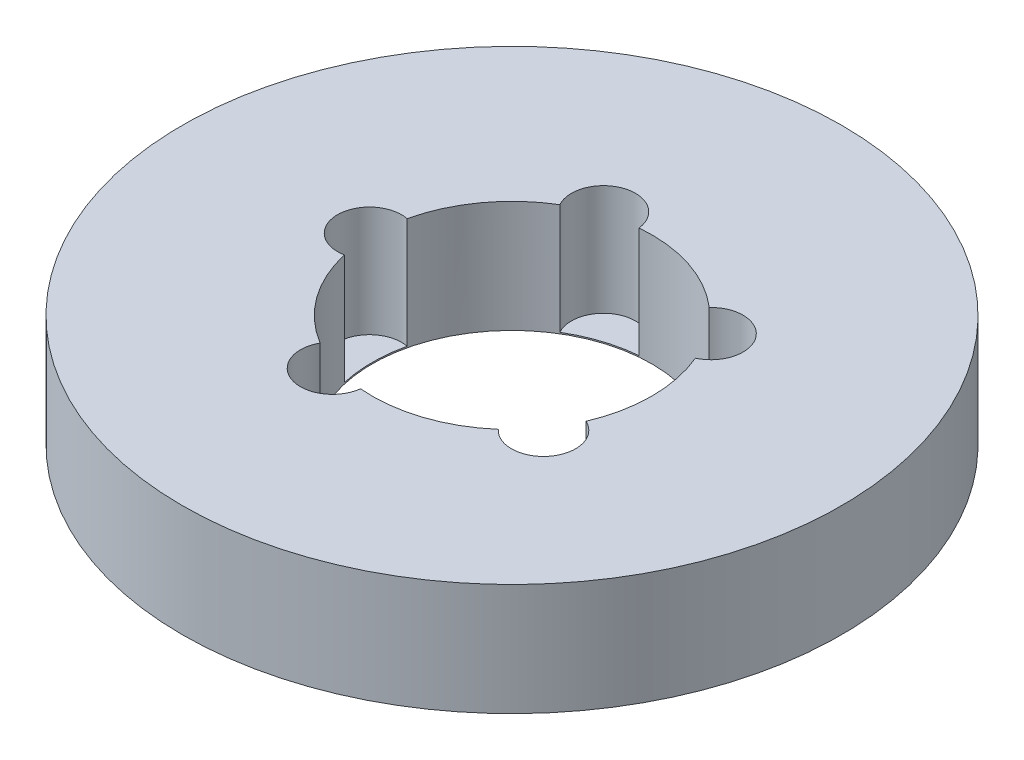
ISO-10303-21;
HEADER;
FILE_DESCRIPTION(('STEP AP214'),'2;1');
FILE_NAME('part.step','',(''),(''),'','','');
FILE_SCHEMA(('AUTOMOTIVE_DESIGN { 1 0 10303 214 1 1 1 1 }'));
ENDSEC;
DATA;
#1=APPLICATION_CONTEXT('core data for automotive mechanical design processes');
#2=APPLICATION_PROTOCOL_DEFINITION('international standard','automotive_design',2000,#1);
#3=PRODUCT_CONTEXT('',#1,'mechanical');
#4=PRODUCT('Part','Part','',(#3));
#5=PRODUCT_RELATED_PRODUCT_CATEGORY('part','',(#4));
#6=PRODUCT_DEFINITION_FORMATION('','',#4);
#7=PRODUCT_DEFINITION_CONTEXT('part definition',#1,'design');
#8=PRODUCT_DEFINITION('design','',#6,#7);
#9=PRODUCT_DEFINITION_SHAPE('','',#8);
#10=(LENGTH_UNIT() NAMED_UNIT(*) SI_UNIT(.MILLI.,.METRE.));
#11=(NAMED_UNIT(*) PLANE_ANGLE_UNIT() SI_UNIT($,.RADIAN.));
#12=(NAMED_UNIT(*) SI_UNIT($,.STERADIAN.) SOLID_ANGLE_UNIT());
#13=UNCERTAINTY_MEASURE_WITH_UNIT(LENGTH_MEASURE(1.E-05),#10,'distance_accuracy_value','');
#14=(GEOMETRIC_REPRESENTATION_CONTEXT(3) GLOBAL_UNCERTAINTY_ASSIGNED_CONTEXT((#13)) GLOBAL_UNIT_ASSIGNED_CONTEXT((#10,
#11,#12)) REPRESENTATION_CONTEXT('',''));
#15=CARTESIAN_POINT('',(0.,0.,0.));
#16=DIRECTION('',(0.,0.,1.));
#17=DIRECTION('',(1.,0.,0.));
#18=AXIS2_PLACEMENT_3D('',#15,#16,#17);
#19=CARTESIAN_POINT('',(0.,28.,0.));
#20=DIRECTION('',(0.,-1.,0.));
#21=DIRECTION('',(0.,0.,-1.));
#22=AXIS2_PLACEMENT_3D('',#19,#20,#21);
#23=CYLINDRICAL_SURFACE('',#22,82.5);
#24=CARTESIAN_POINT('',(0.,28.,0.));
#25=DIRECTION('',(0.,1.,0.));
#26=DIRECTION('',(0.,0.,1.));
#27=AXIS2_PLACEMENT_3D('',#24,#25,#26);
#28=CIRCLE('',#27,82.5);
#29=CARTESIAN_POINT('',(0.,28.,82.5));
#30=VERTEX_POINT('',#29);
#31=EDGE_CURVE('E157',#30,#30,#28,.T.);
#32=ORIENTED_EDGE('',*,*,#31,.F.);
#33=EDGE_LOOP('',(#32));
#34=FACE_BOUND('',#33,.T.);
#35=CARTESIAN_POINT('',(0.,0.,0.));
#36=DIRECTION('',(0.,1.,0.));
#37=DIRECTION('',(0.,0.,1.));
#38=AXIS2_PLACEMENT_3D('',#35,#36,#37);
#39=CIRCLE('',#38,82.5);
#40=CARTESIAN_POINT('',(0.,0.,82.5));
#41=VERTEX_POINT('',#40);
#42=EDGE_CURVE('E150',#41,#41,#39,.T.);
#43=ORIENTED_EDGE('',*,*,#42,.T.);
#44=EDGE_LOOP('',(#43));
#45=FACE_BOUND('',#44,.T.);
#46=ADVANCED_FACE('F39',(#34,#45),#23,.T.);
#47=CARTESIAN_POINT('',(0.,28.,0.));
#48=DIRECTION('',(0.,1.,0.));
#49=DIRECTION('',(0.,0.,1.));
#50=AXIS2_PLACEMENT_3D('',#47,#48,#49);
#51=PLANE('',#50);
#52=CARTESIAN_POINT('',(-11.0212875243932,28.,-33.9200351722985));
#53=DIRECTION('',(0.,1.,0.));
#54=DIRECTION('',(-0.95105651629515,0.,0.309016994374958));
#55=AXIS2_PLACEMENT_3D('',#52,#53,#54);
#56=CIRCLE('',#55,8.02054044185221);
#57=CARTESIAN_POINT('',(-3.0567584288251,28.,-34.8662620294721));
#58=VERTEX_POINT('',#57);
#59=CARTESIAN_POINT('',(-18.020905106871,28.,-30.0041160364566));
#60=VERTEX_POINT('',#59);
#61=EDGE_CURVE('E194',#58,#60,#56,.T.);
#62=ORIENTED_EDGE('',*,*,#61,.F.);
#63=CARTESIAN_POINT('',(0.,28.,0.));
#64=DIRECTION('',(0.,1.,0.));
#65=DIRECTION('',(0.,0.,1.));
#66=AXIS2_PLACEMENT_3D('',#63,#64,#65);
#67=CIRCLE('',#66,35.);
#68=CARTESIAN_POINT('',(22.9668441401066,28.,-26.4106809878892));
#69=VERTEX_POINT('',#68);
#70=EDGE_CURVE('E147',#69,#58,#67,.T.);
#71=ORIENTED_EDGE('',*,*,#70,.F.);
#72=CARTESIAN_POINT('',(28.8541053386453,28.,-20.9637346360727));
#73=DIRECTION('',(0.,1.,0.));
#74=DIRECTION('',(-0.58778525229248,0.,-0.809016994374942));
#75=AXIS2_PLACEMENT_3D('',#72,#73,#74);
#76=CIRCLE('',#75,8.02054044185221);
#77=CARTESIAN_POINT('',(32.2151953997779,28.,-13.681417519911));
#78=VERTEX_POINT('',#77);
#79=EDGE_CURVE('E254',#78,#69,#76,.T.);
#80=ORIENTED_EDGE('',*,*,#79,.F.);
#81=CARTESIAN_POINT('',(32.2151953997781,28.,13.6814175199105));
#82=VERTEX_POINT('',#81);
#83=EDGE_CURVE('E144',#82,#78,#67,.T.);
#84=ORIENTED_EDGE('',*,*,#83,.F.);
#85=CARTESIAN_POINT('',(28.8541053386456,28.,20.9637346360723));
#86=DIRECTION('',(0.,1.,0.));
#87=DIRECTION('',(0.587785252292469,0.,-0.809016994374951));
#88=AXIS2_PLACEMENT_3D('',#85,#86,#87);
#89=CIRCLE('',#88,8.02054044185221);
#90=CARTESIAN_POINT('',(22.966844140107,28.,26.4106809878889));
#91=VERTEX_POINT('',#90);
#92=EDGE_CURVE('E141',#91,#82,#89,.T.);
#93=ORIENTED_EDGE('',*,*,#92,.F.);
#94=CARTESIAN_POINT('',(-3.05675842882461,28.,34.8662620294721));
#95=VERTEX_POINT('',#94);
#96=EDGE_CURVE('E134',#95,#91,#67,.T.);
#97=ORIENTED_EDGE('',*,*,#96,.F.);
#98=CARTESIAN_POINT('',(-11.0212875243927,28.,33.9200351722987));
#99=DIRECTION('',(0.,1.,0.));
#100=DIRECTION('',(0.951056516295155,0.,0.309016994374945));
#101=AXIS2_PLACEMENT_3D('',#98,#99,#100);
#102=CIRCLE('',#101,8.02054044185221);
#103=CARTESIAN_POINT('',(-18.0209051068706,28.,30.0041160364568));
#104=VERTEX_POINT('',#103);
#105=EDGE_CURVE('E111',#104,#95,#102,.T.);
#106=ORIENTED_EDGE('',*,*,#105,.F.);
#107=CARTESIAN_POINT('',(-34.1043760041894,28.,7.86711747496296));
#108=VERTEX_POINT('',#107);
#109=EDGE_CURVE('E145',#108,#104,#67,.T.);
#110=ORIENTED_EDGE('',*,*,#109,.F.);
#111=CARTESIAN_POINT('',(-35.6656356285054,28.,0.));
#112=DIRECTION('',(0.,1.,0.));
#113=DIRECTION('',(0.,0.,1.));
#114=AXIS2_PLACEMENT_3D('',#111,#112,#113);
#115=CIRCLE('',#114,8.02054044185221);
#116=CARTESIAN_POINT('',(-34.1043760041894,28.,-7.86711747496296));
#117=VERTEX_POINT('',#116);
#118=EDGE_CURVE('E153',#117,#108,#115,.T.);
#119=ORIENTED_EDGE('',*,*,#118,.F.);
#120=EDGE_CURVE('E146',#60,#117,#67,.T.);
#121=ORIENTED_EDGE('',*,*,#120,.F.);
#122=EDGE_LOOP('',(#62,#71,#80,#84,#93,#97,#106,#110,#119,#121));
#123=FACE_BOUND('',#122,.T.);
#124=ORIENTED_EDGE('',*,*,#31,.T.);
#125=EDGE_LOOP('',(#124));
#126=FACE_BOUND('',#125,.T.);
#127=ADVANCED_FACE('F139',(#123,#126),#51,.T.);
#128=CARTESIAN_POINT('',(0.,0.,0.));
#129=DIRECTION('',(0.,1.,0.));
#130=DIRECTION('',(0.,0.,1.));
#131=AXIS2_PLACEMENT_3D('',#128,#129,#130);
#132=PLANE('',#131);
#133=CARTESIAN_POINT('',(0.,0.,0.));
#134=DIRECTION('',(0.,1.,0.));
#135=DIRECTION('',(0.,0.,1.));
#136=AXIS2_PLACEMENT_3D('',#133,#134,#135);
#137=CIRCLE('',#136,35.);
#138=CARTESIAN_POINT('',(0.,0.,35.));
#139=VERTEX_POINT('',#138);
#140=EDGE_CURVE('E154',#139,#139,#137,.T.);
#141=ORIENTED_EDGE('',*,*,#140,.T.);
#142=EDGE_LOOP('',(#141));
#143=FACE_BOUND('',#142,.T.);
#144=ORIENTED_EDGE('',*,*,#42,.F.);
#145=EDGE_LOOP('',(#144));
#146=FACE_BOUND('',#145,.T.);
#147=ADVANCED_FACE('F213',(#143,#146),#132,.F.);
#148=CARTESIAN_POINT('',(0.,28.,0.));
#149=DIRECTION('',(0.,-1.,0.));
#150=DIRECTION('',(0.,0.,-1.));
#151=AXIS2_PLACEMENT_3D('',#148,#149,#150);
#152=CYLINDRICAL_SURFACE('',#151,35.);
#153=DIRECTION('',(0.,1.,0.));
#154=VECTOR('',#153,1.);
#155=CARTESIAN_POINT('',(-3.0567584288251,14.162641871456,-34.8662620294721));
#156=LINE('',#155,#154);
#157=CARTESIAN_POINT('',(-3.0567584288251,0.325283742912054,-34.8662620294721));
#158=VERTEX_POINT('',#157);
#159=EDGE_CURVE('E11',#158,#58,#156,.T.);
#160=ORIENTED_EDGE('',*,*,#159,.F.);
#161=CARTESIAN_POINT('',(0.,0.325283742912054,0.));
#162=DIRECTION('',(0.,1.,0.));
#163=DIRECTION('',(0.,0.,1.));
#164=AXIS2_PLACEMENT_3D('',#161,#162,#163);
#165=CIRCLE('',#164,35.);
#166=CARTESIAN_POINT('',(-18.020905106871,0.325283742912054,-30.0041160364566));
#167=VERTEX_POINT('',#166);
#168=EDGE_CURVE('E189',#158,#167,#165,.T.);
#169=ORIENTED_EDGE('',*,*,#168,.T.);
#170=DIRECTION('',(0.,1.,0.));
#171=VECTOR('',#170,1.);
#172=CARTESIAN_POINT('',(-18.020905106871,14.162641871456,-30.0041160364566));
#173=LINE('',#172,#171);
#174=EDGE_CURVE('E46',#60,#167,#173,.F.);
#175=ORIENTED_EDGE('',*,*,#174,.F.);
#176=ORIENTED_EDGE('',*,*,#120,.T.);
#177=DIRECTION('',(0.,1.,0.));
#178=VECTOR('',#177,1.);
#179=CARTESIAN_POINT('',(-34.1043760041894,14.162641871456,-7.86711747496296));
#180=LINE('',#179,#178);
#181=CARTESIAN_POINT('',(-34.1043760041894,0.325283742912054,-7.86711747496296));
#182=VERTEX_POINT('',#181);
#183=EDGE_CURVE('E168',#182,#117,#180,.T.);
#184=ORIENTED_EDGE('',*,*,#183,.F.);
#185=CARTESIAN_POINT('',(0.,0.325283742912054,0.));
#186=DIRECTION('',(0.,1.,0.));
#187=DIRECTION('',(0.,0.,1.));
#188=AXIS2_PLACEMENT_3D('',#185,#186,#187);
#189=CIRCLE('',#188,35.);
#190=CARTESIAN_POINT('',(-34.1043760041894,0.325283742912054,7.86711747496296));
#191=VERTEX_POINT('',#190);
#192=EDGE_CURVE('E165',#182,#191,#189,.T.);
#193=ORIENTED_EDGE('',*,*,#192,.T.);
#194=DIRECTION('',(0.,1.,0.));
#195=VECTOR('',#194,1.);
#196=CARTESIAN_POINT('',(-34.1043760041894,14.162641871456,7.86711747496296));
#197=LINE('',#196,#195);
#198=EDGE_CURVE('E170',#108,#191,#197,.F.);
#199=ORIENTED_EDGE('',*,*,#198,.F.);
#200=ORIENTED_EDGE('',*,*,#109,.T.);
#201=DIRECTION('',(0.,1.,0.));
#202=VECTOR('',#201,1.);
#203=CARTESIAN_POINT('',(-18.0209051068706,14.162641871456,30.0041160364568));
#204=LINE('',#203,#202);
#205=CARTESIAN_POINT('',(-18.0209051068706,0.325283742912054,30.0041160364568));
#206=VERTEX_POINT('',#205);
#207=EDGE_CURVE('E121',#206,#104,#204,.T.);
#208=ORIENTED_EDGE('',*,*,#207,.F.);
#209=CARTESIAN_POINT('',(0.,0.325283742912054,0.));
#210=DIRECTION('',(0.,1.,0.));
#211=DIRECTION('',(0.,0.,1.));
#212=AXIS2_PLACEMENT_3D('',#209,#210,#211);
#213=CIRCLE('',#212,35.);
#214=CARTESIAN_POINT('',(-3.05675842882461,0.325283742912054,34.8662620294721));
#215=VERTEX_POINT('',#214);
#216=EDGE_CURVE('E136',#206,#215,#213,.T.);
#217=ORIENTED_EDGE('',*,*,#216,.T.);
#218=DIRECTION('',(0.,1.,0.));
#219=VECTOR('',#218,1.);
#220=CARTESIAN_POINT('',(-3.05675842882461,14.162641871456,34.8662620294721));
#221=LINE('',#220,#219);
#222=EDGE_CURVE('E117',#95,#215,#221,.F.);
#223=ORIENTED_EDGE('',*,*,#222,.F.);
#224=ORIENTED_EDGE('',*,*,#96,.T.);
#225=DIRECTION('',(0.,1.,0.));
#226=VECTOR('',#225,1.);
#227=CARTESIAN_POINT('',(22.966844140107,14.162641871456,26.4106809878889));
#228=LINE('',#227,#226);
#229=CARTESIAN_POINT('',(22.966844140107,0.325283742912054,26.4106809878889));
#230=VERTEX_POINT('',#229);
#231=EDGE_CURVE('E182',#230,#91,#228,.T.);
#232=ORIENTED_EDGE('',*,*,#231,.F.);
#233=CARTESIAN_POINT('',(0.,0.325283742912054,0.));
#234=DIRECTION('',(0.,1.,0.));
#235=DIRECTION('',(0.,0.,1.));
#236=AXIS2_PLACEMENT_3D('',#233,#234,#235);
#237=CIRCLE('',#236,35.);
#238=CARTESIAN_POINT('',(32.2151953997781,0.325283742912054,13.6814175199105));
#239=VERTEX_POINT('',#238);
#240=EDGE_CURVE('E174',#230,#239,#237,.T.);
#241=ORIENTED_EDGE('',*,*,#240,.T.);
#242=DIRECTION('',(0.,1.,0.));
#243=VECTOR('',#242,1.);
#244=CARTESIAN_POINT('',(32.2151953997781,14.162641871456,13.6814175199105));
#245=LINE('',#244,#243);
#246=EDGE_CURVE('E177',#82,#239,#245,.F.);
#247=ORIENTED_EDGE('',*,*,#246,.F.);
#248=ORIENTED_EDGE('',*,*,#83,.T.);
#249=DIRECTION('',(0.,1.,0.));
#250=VECTOR('',#249,1.);
#251=CARTESIAN_POINT('',(32.2151953997779,14.162641871456,-13.681417519911));
#252=LINE('',#251,#250);
#253=CARTESIAN_POINT('',(32.2151953997779,0.325283742912054,-13.681417519911));
#254=VERTEX_POINT('',#253);
#255=EDGE_CURVE('E187',#254,#78,#252,.T.);
#256=ORIENTED_EDGE('',*,*,#255,.F.);
#257=CARTESIAN_POINT('',(0.,0.325283742912054,0.));
#258=DIRECTION('',(0.,1.,0.));
#259=DIRECTION('',(0.,0.,1.));
#260=AXIS2_PLACEMENT_3D('',#257,#258,#259);
#261=CIRCLE('',#260,35.);
#262=CARTESIAN_POINT('',(22.9668441401066,0.325283742912054,-26.4106809878892));
#263=VERTEX_POINT('',#262);
#264=EDGE_CURVE('E181',#254,#263,#261,.T.);
#265=ORIENTED_EDGE('',*,*,#264,.T.);
#266=DIRECTION('',(0.,1.,0.));
#267=VECTOR('',#266,1.);
#268=CARTESIAN_POINT('',(22.9668441401066,14.162641871456,-26.4106809878892));
#269=LINE('',#268,#267);
#270=EDGE_CURVE('E186',#69,#263,#269,.F.);
#271=ORIENTED_EDGE('',*,*,#270,.F.);
#272=ORIENTED_EDGE('',*,*,#70,.T.);
#273=EDGE_LOOP('',(#160,#169,#175,#176,#184,#193,#199,#200,#208,#217,#223,#224,#232,#241,#247,
#248,#256,#265,#271,#272));
#274=FACE_BOUND('',#273,.T.);
#275=ORIENTED_EDGE('',*,*,#140,.F.);
#276=EDGE_LOOP('',(#275));
#277=FACE_BOUND('',#276,.T.);
#278=ADVANCED_FACE('F135',(#274,#277),#152,.F.);
#279=CARTESIAN_POINT('',(-35.6656356285054,0.325283742912054,0.));
#280=DIRECTION('',(0.,1.,0.));
#281=DIRECTION('',(0.,0.,1.));
#282=AXIS2_PLACEMENT_3D('',#279,#280,#281);
#283=CYLINDRICAL_SURFACE('',#282,8.02054044185221);
#284=ORIENTED_EDGE('',*,*,#183,.T.);
#285=ORIENTED_EDGE('',*,*,#118,.T.);
#286=ORIENTED_EDGE('',*,*,#198,.T.);
#287=CARTESIAN_POINT('',(-35.6656356285054,0.325283742912054,0.));
#288=DIRECTION('',(0.,1.,0.));
#289=DIRECTION('',(0.,0.,1.));
#290=AXIS2_PLACEMENT_3D('',#287,#288,#289);
#291=CIRCLE('',#290,8.02054044185221);
#292=EDGE_CURVE('E158',#182,#191,#291,.T.);
#293=ORIENTED_EDGE('',*,*,#292,.F.);
#294=EDGE_LOOP('',(#284,#285,#286,#293));
#295=FACE_BOUND('',#294,.T.);
#296=ADVANCED_FACE('F221',(#295),#283,.F.);
#297=CARTESIAN_POINT('',(-35.6656356285054,0.325283742912054,0.));
#298=DIRECTION('',(0.,1.,0.));
#299=DIRECTION('',(0.,0.,1.));
#300=AXIS2_PLACEMENT_3D('',#297,#298,#299);
#301=PLANE('',#300);
#302=ORIENTED_EDGE('',*,*,#292,.T.);
#303=ORIENTED_EDGE('',*,*,#192,.F.);
#304=EDGE_LOOP('',(#302,#303));
#305=FACE_BOUND('',#304,.T.);
#306=ADVANCED_FACE('F227',(#305),#301,.T.);
#307=CARTESIAN_POINT('',(-11.0212875243927,0.325283742912054,33.9200351722987));
#308=DIRECTION('',(0.,1.,0.));
#309=DIRECTION('',(0.,0.,1.));
#310=AXIS2_PLACEMENT_3D('',#307,#308,#309);
#311=CYLINDRICAL_SURFACE('',#310,8.02054044185221);
#312=ORIENTED_EDGE('',*,*,#207,.T.);
#313=ORIENTED_EDGE('',*,*,#105,.T.);
#314=ORIENTED_EDGE('',*,*,#222,.T.);
#315=CARTESIAN_POINT('',(-11.0212875243927,0.325283742912054,33.9200351722987));
#316=DIRECTION('',(0.,1.,0.));
#317=DIRECTION('',(0.951056516295155,0.,0.309016994374945));
#318=AXIS2_PLACEMENT_3D('',#315,#316,#317);
#319=CIRCLE('',#318,8.02054044185221);
#320=EDGE_CURVE('E127',#206,#215,#319,.T.);
#321=ORIENTED_EDGE('',*,*,#320,.F.);
#322=EDGE_LOOP('',(#312,#313,#314,#321));
#323=FACE_BOUND('',#322,.T.);
#324=ADVANCED_FACE('F116',(#323),#311,.F.);
#325=CARTESIAN_POINT('',(-11.0212875243927,0.325283742912054,33.9200351722987));
#326=DIRECTION('',(0.,1.,0.));
#327=DIRECTION('',(0.951056516295155,0.,0.309016994374945));
#328=AXIS2_PLACEMENT_3D('',#325,#326,#327);
#329=PLANE('',#328);
#330=ORIENTED_EDGE('',*,*,#320,.T.);
#331=ORIENTED_EDGE('',*,*,#216,.F.);
#332=EDGE_LOOP('',(#330,#331));
#333=FACE_BOUND('',#332,.T.);
#334=ADVANCED_FACE('F234',(#333),#329,.T.);
#335=CARTESIAN_POINT('',(28.8541053386456,0.325283742912054,20.9637346360723));
#336=DIRECTION('',(0.,1.,0.));
#337=DIRECTION('',(0.,0.,1.));
#338=AXIS2_PLACEMENT_3D('',#335,#336,#337);
#339=CYLINDRICAL_SURFACE('',#338,8.02054044185221);
#340=ORIENTED_EDGE('',*,*,#231,.T.);
#341=ORIENTED_EDGE('',*,*,#92,.T.);
#342=ORIENTED_EDGE('',*,*,#246,.T.);
#343=CARTESIAN_POINT('',(28.8541053386456,0.325283742912054,20.9637346360723));
#344=DIRECTION('',(0.,1.,0.));
#345=DIRECTION('',(0.587785252292469,0.,-0.809016994374951));
#346=AXIS2_PLACEMENT_3D('',#343,#344,#345);
#347=CIRCLE('',#346,8.02054044185221);
#348=EDGE_CURVE('E130',#230,#239,#347,.T.);
#349=ORIENTED_EDGE('',*,*,#348,.F.);
#350=EDGE_LOOP('',(#340,#341,#342,#349));
#351=FACE_BOUND('',#350,.T.);
#352=ADVANCED_FACE('F240',(#351),#339,.F.);
#353=CARTESIAN_POINT('',(28.8541053386456,0.325283742912054,20.9637346360723));
#354=DIRECTION('',(0.,1.,0.));
#355=DIRECTION('',(0.587785252292469,0.,-0.809016994374951));
#356=AXIS2_PLACEMENT_3D('',#353,#354,#355);
#357=PLANE('',#356);
#358=ORIENTED_EDGE('',*,*,#348,.T.);
#359=ORIENTED_EDGE('',*,*,#240,.F.);
#360=EDGE_LOOP('',(#358,#359));
#361=FACE_BOUND('',#360,.T.);
#362=ADVANCED_FACE('F245',(#361),#357,.T.);
#363=CARTESIAN_POINT('',(28.8541053386453,0.325283742912054,-20.9637346360727));
#364=DIRECTION('',(0.,1.,0.));
#365=DIRECTION('',(0.,0.,1.));
#366=AXIS2_PLACEMENT_3D('',#363,#364,#365);
#367=CYLINDRICAL_SURFACE('',#366,8.02054044185221);
#368=ORIENTED_EDGE('',*,*,#255,.T.);
#369=ORIENTED_EDGE('',*,*,#79,.T.);
#370=ORIENTED_EDGE('',*,*,#270,.T.);
#371=CARTESIAN_POINT('',(28.8541053386453,0.325283742912054,-20.9637346360727));
#372=DIRECTION('',(0.,1.,0.));
#373=DIRECTION('',(-0.58778525229248,0.,-0.809016994374942));
#374=AXIS2_PLACEMENT_3D('',#371,#372,#373);
#375=CIRCLE('',#374,8.02054044185221);
#376=EDGE_CURVE('E56',#254,#263,#375,.T.);
#377=ORIENTED_EDGE('',*,*,#376,.F.);
#378=EDGE_LOOP('',(#368,#369,#370,#377));
#379=FACE_BOUND('',#378,.T.);
#380=ADVANCED_FACE('F266',(#379),#367,.F.);
#381=CARTESIAN_POINT('',(28.8541053386453,0.325283742912054,-20.9637346360727));
#382=DIRECTION('',(0.,1.,0.));
#383=DIRECTION('',(-0.58778525229248,0.,-0.809016994374942));
#384=AXIS2_PLACEMENT_3D('',#381,#382,#383);
#385=PLANE('',#384);
#386=ORIENTED_EDGE('',*,*,#376,.T.);
#387=ORIENTED_EDGE('',*,*,#264,.F.);
#388=EDGE_LOOP('',(#386,#387));
#389=FACE_BOUND('',#388,.T.);
#390=ADVANCED_FACE('F204',(#389),#385,.T.);
#391=CARTESIAN_POINT('',(-11.0212875243932,0.325283742912054,-33.9200351722985));
#392=DIRECTION('',(0.,1.,0.));
#393=DIRECTION('',(0.,0.,1.));
#394=AXIS2_PLACEMENT_3D('',#391,#392,#393);
#395=CYLINDRICAL_SURFACE('',#394,8.02054044185221);
#396=ORIENTED_EDGE('',*,*,#159,.T.);
#397=ORIENTED_EDGE('',*,*,#61,.T.);
#398=ORIENTED_EDGE('',*,*,#174,.T.);
#399=CARTESIAN_POINT('',(-11.0212875243932,0.325283742912054,-33.9200351722985));
#400=DIRECTION('',(0.,1.,0.));
#401=DIRECTION('',(-0.95105651629515,0.,0.309016994374958));
#402=AXIS2_PLACEMENT_3D('',#399,#400,#401);
#403=CIRCLE('',#402,8.02054044185221);
#404=EDGE_CURVE('E55',#158,#167,#403,.T.);
#405=ORIENTED_EDGE('',*,*,#404,.F.);
#406=EDGE_LOOP('',(#396,#397,#398,#405));
#407=FACE_BOUND('',#406,.T.);
#408=ADVANCED_FACE('F193',(#407),#395,.F.);
#409=CARTESIAN_POINT('',(-11.0212875243932,0.325283742912054,-33.9200351722985));
#410=DIRECTION('',(0.,1.,0.));
#411=DIRECTION('',(-0.95105651629515,0.,0.309016994374958));
#412=AXIS2_PLACEMENT_3D('',#409,#410,#411);
#413=PLANE('',#412);
#414=ORIENTED_EDGE('',*,*,#404,.T.);
#415=ORIENTED_EDGE('',*,*,#168,.F.);
#416=EDGE_LOOP('',(#414,#415));
#417=FACE_BOUND('',#416,.T.);
#418=ADVANCED_FACE('F196',(#417),#413,.T.);
#419=CLOSED_SHELL('',(#46,#127,#147,#278,#296,#306,#324,#334,#352,#362,#380,#390,#408,#418));
#420=MANIFOLD_SOLID_BREP('B2',#419);
#421=ADVANCED_BREP_SHAPE_REPRESENTATION('',(#18,#420),#14);
#422=SHAPE_DEFINITION_REPRESENTATION(#9,#421);
ENDSEC;
END-ISO-10303-21;
